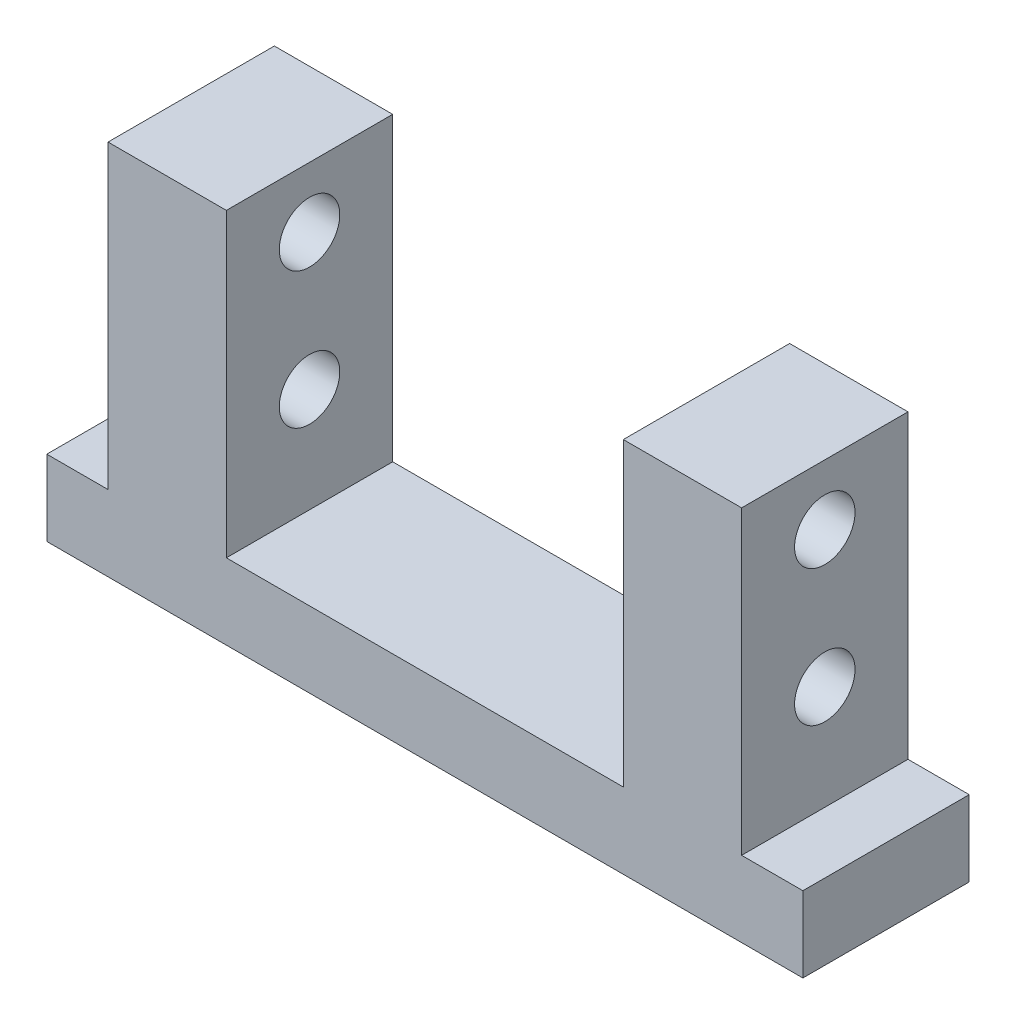
ISO-10303-21;
HEADER;
FILE_DESCRIPTION(('STEP AP214'),'2;1');
FILE_NAME('part.step','',(''),(''),'','','');
FILE_SCHEMA(('AUTOMOTIVE_DESIGN { 1 0 10303 214 1 1 1 1 }'));
ENDSEC;
DATA;
#1=APPLICATION_CONTEXT('core data for automotive mechanical design processes');
#2=APPLICATION_PROTOCOL_DEFINITION('international standard','automotive_design',2000,#1);
#3=PRODUCT_CONTEXT('',#1,'mechanical');
#4=PRODUCT('Part','Part','',(#3));
#5=PRODUCT_RELATED_PRODUCT_CATEGORY('part','',(#4));
#6=PRODUCT_DEFINITION_FORMATION('','',#4);
#7=PRODUCT_DEFINITION_CONTEXT('part definition',#1,'design');
#8=PRODUCT_DEFINITION('design','',#6,#7);
#9=PRODUCT_DEFINITION_SHAPE('','',#8);
#10=(LENGTH_UNIT() NAMED_UNIT(*) SI_UNIT(.MILLI.,.METRE.));
#11=(NAMED_UNIT(*) PLANE_ANGLE_UNIT() SI_UNIT($,.RADIAN.));
#12=(NAMED_UNIT(*) SI_UNIT($,.STERADIAN.) SOLID_ANGLE_UNIT());
#13=UNCERTAINTY_MEASURE_WITH_UNIT(LENGTH_MEASURE(1.E-05),#10,'distance_accuracy_value','');
#14=(GEOMETRIC_REPRESENTATION_CONTEXT(3) GLOBAL_UNCERTAINTY_ASSIGNED_CONTEXT((#13)) GLOBAL_UNIT_ASSIGNED_CONTEXT((#10,
#11,#12)) REPRESENTATION_CONTEXT('',''));
#15=CARTESIAN_POINT('',(0.,0.,0.));
#16=DIRECTION('',(0.,0.,1.));
#17=DIRECTION('',(1.,0.,0.));
#18=AXIS2_PLACEMENT_3D('',#15,#16,#17);
#19=CARTESIAN_POINT('',(0.,49.8,0.));
#20=DIRECTION('',(0.,1.,0.));
#21=DIRECTION('',(0.,0.,1.));
#22=AXIS2_PLACEMENT_3D('',#19,#20,#21);
#23=PLANE('',#22);
#24=DIRECTION('',(0.,0.,1.));
#25=VECTOR('',#24,1.);
#26=CARTESIAN_POINT('',(-26.25,49.8,11.));
#27=LINE('',#26,#25);
#28=CARTESIAN_POINT('',(-26.25,49.8,-11.));
#29=VERTEX_POINT('',#28);
#30=CARTESIAN_POINT('',(-26.25,49.8,11.));
#31=VERTEX_POINT('',#30);
#32=EDGE_CURVE('E128',#29,#31,#27,.T.);
#33=ORIENTED_EDGE('',*,*,#32,.F.);
#34=DIRECTION('',(-1.,0.,0.));
#35=VECTOR('',#34,1.);
#36=CARTESIAN_POINT('',(41.9,49.8,-11.));
#37=LINE('',#36,#35);
#38=CARTESIAN_POINT('',(-41.9,49.8,-11.));
#39=VERTEX_POINT('',#38);
#40=EDGE_CURVE('E169',#29,#39,#37,.T.);
#41=ORIENTED_EDGE('',*,*,#40,.T.);
#42=DIRECTION('',(0.,0.,1.));
#43=VECTOR('',#42,1.);
#44=CARTESIAN_POINT('',(-41.9,49.8,11.));
#45=LINE('',#44,#43);
#46=CARTESIAN_POINT('',(-41.9,49.8,11.));
#47=VERTEX_POINT('',#46);
#48=EDGE_CURVE('E161',#39,#47,#45,.T.);
#49=ORIENTED_EDGE('',*,*,#48,.T.);
#50=DIRECTION('',(1.,0.,0.));
#51=VECTOR('',#50,1.);
#52=CARTESIAN_POINT('',(41.9,49.8,11.));
#53=LINE('',#52,#51);
#54=EDGE_CURVE('E165',#47,#31,#53,.T.);
#55=ORIENTED_EDGE('',*,*,#54,.T.);
#56=EDGE_LOOP('',(#33,#41,#49,#55));
#57=FACE_BOUND('',#56,.T.);
#58=ADVANCED_FACE('F32',(#57),#23,.T.);
#59=CARTESIAN_POINT('',(0.,10.,0.));
#60=DIRECTION('',(0.,-1.,0.));
#61=DIRECTION('',(0.,0.,-1.));
#62=AXIS2_PLACEMENT_3D('',#59,#60,#61);
#63=PLANE('',#62);
#64=DIRECTION('',(0.,0.,1.));
#65=VECTOR('',#64,1.);
#66=CARTESIAN_POINT('',(-41.9,10.,11.));
#67=LINE('',#66,#65);
#68=CARTESIAN_POINT('',(-41.9,10.,-11.));
#69=VERTEX_POINT('',#68);
#70=CARTESIAN_POINT('',(-41.9,10.,11.));
#71=VERTEX_POINT('',#70);
#72=EDGE_CURVE('E156',#69,#71,#67,.T.);
#73=ORIENTED_EDGE('',*,*,#72,.F.);
#74=DIRECTION('',(-1.,0.,0.));
#75=VECTOR('',#74,1.);
#76=CARTESIAN_POINT('',(-50.,10.,-11.));
#77=LINE('',#76,#75);
#78=CARTESIAN_POINT('',(-50.,10.,-11.));
#79=VERTEX_POINT('',#78);
#80=EDGE_CURVE('E288',#69,#79,#77,.T.);
#81=ORIENTED_EDGE('',*,*,#80,.T.);
#82=DIRECTION('',(0.,0.,1.));
#83=VECTOR('',#82,1.);
#84=CARTESIAN_POINT('',(-50.,10.,11.));
#85=LINE('',#84,#83);
#86=CARTESIAN_POINT('',(-50.,10.,11.));
#87=VERTEX_POINT('',#86);
#88=EDGE_CURVE('E297',#79,#87,#85,.T.);
#89=ORIENTED_EDGE('',*,*,#88,.T.);
#90=DIRECTION('',(1.,0.,0.));
#91=VECTOR('',#90,1.);
#92=CARTESIAN_POINT('',(-50.,10.,11.));
#93=LINE('',#92,#91);
#94=EDGE_CURVE('E291',#87,#71,#93,.T.);
#95=ORIENTED_EDGE('',*,*,#94,.T.);
#96=EDGE_LOOP('',(#73,#81,#89,#95));
#97=FACE_BOUND('',#96,.T.);
#98=ADVANCED_FACE('F225',(#97),#63,.F.);
#99=DIRECTION('',(0.,0.,-1.));
#100=VECTOR('',#99,1.);
#101=CARTESIAN_POINT('',(41.9,10.,11.));
#102=LINE('',#101,#100);
#103=CARTESIAN_POINT('',(41.9,10.,11.));
#104=VERTEX_POINT('',#103);
#105=CARTESIAN_POINT('',(41.9,10.,-11.));
#106=VERTEX_POINT('',#105);
#107=EDGE_CURVE('E57',#104,#106,#102,.T.);
#108=ORIENTED_EDGE('',*,*,#107,.F.);
#109=CARTESIAN_POINT('',(50.,10.,11.));
#110=VERTEX_POINT('',#109);
#111=EDGE_CURVE('E252',#104,#110,#93,.T.);
#112=ORIENTED_EDGE('',*,*,#111,.T.);
#113=DIRECTION('',(0.,0.,-1.));
#114=VECTOR('',#113,1.);
#115=CARTESIAN_POINT('',(50.,10.,11.));
#116=LINE('',#115,#114);
#117=CARTESIAN_POINT('',(50.,10.,-11.));
#118=VERTEX_POINT('',#117);
#119=EDGE_CURVE('E295',#110,#118,#116,.T.);
#120=ORIENTED_EDGE('',*,*,#119,.T.);
#121=EDGE_CURVE('E294',#118,#106,#77,.T.);
#122=ORIENTED_EDGE('',*,*,#121,.T.);
#123=EDGE_LOOP('',(#108,#112,#120,#122));
#124=FACE_BOUND('',#123,.T.);
#125=ADVANCED_FACE('F232',(#124),#63,.F.);
#126=CARTESIAN_POINT('',(50.,10.,11.));
#127=DIRECTION('',(-1.,0.,0.));
#128=DIRECTION('',(0.,0.,1.));
#129=AXIS2_PLACEMENT_3D('',#126,#127,#128);
#130=PLANE('',#129);
#131=DIRECTION('',(0.,0.,-1.));
#132=VECTOR('',#131,1.);
#133=CARTESIAN_POINT('',(50.,0.,11.));
#134=LINE('',#133,#132);
#135=CARTESIAN_POINT('',(50.,0.,11.));
#136=VERTEX_POINT('',#135);
#137=CARTESIAN_POINT('',(50.,0.,-11.));
#138=VERTEX_POINT('',#137);
#139=EDGE_CURVE('E310',#136,#138,#134,.T.);
#140=ORIENTED_EDGE('',*,*,#139,.T.);
#141=DIRECTION('',(0.,-1.,0.));
#142=VECTOR('',#141,1.);
#143=CARTESIAN_POINT('',(50.,10.,-11.));
#144=LINE('',#143,#142);
#145=EDGE_CURVE('E11',#118,#138,#144,.T.);
#146=ORIENTED_EDGE('',*,*,#145,.F.);
#147=ORIENTED_EDGE('',*,*,#119,.F.);
#148=DIRECTION('',(0.,-1.,0.));
#149=VECTOR('',#148,1.);
#150=CARTESIAN_POINT('',(50.,10.,11.));
#151=LINE('',#150,#149);
#152=EDGE_CURVE('E328',#110,#136,#151,.T.);
#153=ORIENTED_EDGE('',*,*,#152,.T.);
#154=EDGE_LOOP('',(#140,#146,#147,#153));
#155=FACE_BOUND('',#154,.T.);
#156=ADVANCED_FACE('F34',(#155),#130,.F.);
#157=CARTESIAN_POINT('',(-50.,10.,-11.));
#158=DIRECTION('',(0.,0.,1.));
#159=DIRECTION('',(1.,0.,0.));
#160=AXIS2_PLACEMENT_3D('',#157,#158,#159);
#161=PLANE('',#160);
#162=ORIENTED_EDGE('',*,*,#40,.F.);
#163=DIRECTION('',(0.,1.,0.));
#164=VECTOR('',#163,1.);
#165=CARTESIAN_POINT('',(-26.25,10.,-11.));
#166=LINE('',#165,#164);
#167=CARTESIAN_POINT('',(-26.25,10.,-11.));
#168=VERTEX_POINT('',#167);
#169=EDGE_CURVE('E154',#168,#29,#166,.T.);
#170=ORIENTED_EDGE('',*,*,#169,.F.);
#171=DIRECTION('',(-1.,0.,0.));
#172=VECTOR('',#171,1.);
#173=CARTESIAN_POINT('',(26.25,10.,-11.));
#174=LINE('',#173,#172);
#175=CARTESIAN_POINT('',(26.25,10.,-11.));
#176=VERTEX_POINT('',#175);
#177=EDGE_CURVE('E132',#176,#168,#174,.T.);
#178=ORIENTED_EDGE('',*,*,#177,.F.);
#179=DIRECTION('',(0.,1.,0.));
#180=VECTOR('',#179,1.);
#181=CARTESIAN_POINT('',(26.25,10.,-11.));
#182=LINE('',#181,#180);
#183=CARTESIAN_POINT('',(26.25,49.8,-11.));
#184=VERTEX_POINT('',#183);
#185=EDGE_CURVE('E157',#176,#184,#182,.T.);
#186=ORIENTED_EDGE('',*,*,#185,.T.);
#187=CARTESIAN_POINT('',(41.9,49.8,-11.));
#188=VERTEX_POINT('',#187);
#189=EDGE_CURVE('E170',#188,#184,#37,.T.);
#190=ORIENTED_EDGE('',*,*,#189,.F.);
#191=DIRECTION('',(0.,-1.,0.));
#192=VECTOR('',#191,1.);
#193=CARTESIAN_POINT('',(41.9,49.8,-11.));
#194=LINE('',#193,#192);
#195=EDGE_CURVE('E186',#188,#106,#194,.T.);
#196=ORIENTED_EDGE('',*,*,#195,.T.);
#197=ORIENTED_EDGE('',*,*,#121,.F.);
#198=ORIENTED_EDGE('',*,*,#145,.T.);
#199=DIRECTION('',(-1.,0.,0.));
#200=VECTOR('',#199,1.);
#201=CARTESIAN_POINT('',(-50.,0.,-11.));
#202=LINE('',#201,#200);
#203=CARTESIAN_POINT('',(-50.,0.,-11.));
#204=VERTEX_POINT('',#203);
#205=EDGE_CURVE('E319',#138,#204,#202,.T.);
#206=ORIENTED_EDGE('',*,*,#205,.T.);
#207=DIRECTION('',(0.,-1.,0.));
#208=VECTOR('',#207,1.);
#209=CARTESIAN_POINT('',(-50.,10.,-11.));
#210=LINE('',#209,#208);
#211=EDGE_CURVE('E41',#79,#204,#210,.T.);
#212=ORIENTED_EDGE('',*,*,#211,.F.);
#213=ORIENTED_EDGE('',*,*,#80,.F.);
#214=DIRECTION('',(0.,-1.,0.));
#215=VECTOR('',#214,1.);
#216=CARTESIAN_POINT('',(-41.9,49.8,-11.));
#217=LINE('',#216,#215);
#218=EDGE_CURVE('E173',#39,#69,#217,.T.);
#219=ORIENTED_EDGE('',*,*,#218,.F.);
#220=EDGE_LOOP('',(#162,#170,#178,#186,#190,#196,#197,#198,#206,#212,#213,#219));
#221=FACE_BOUND('',#220,.T.);
#222=ADVANCED_FACE('F260',(#221),#161,.F.);
#223=CARTESIAN_POINT('',(-50.,10.,11.));
#224=DIRECTION('',(1.,0.,0.));
#225=DIRECTION('',(0.,0.,-1.));
#226=AXIS2_PLACEMENT_3D('',#223,#224,#225);
#227=PLANE('',#226);
#228=DIRECTION('',(0.,0.,1.));
#229=VECTOR('',#228,1.);
#230=CARTESIAN_POINT('',(-50.,0.,11.));
#231=LINE('',#230,#229);
#232=CARTESIAN_POINT('',(-50.,0.,11.));
#233=VERTEX_POINT('',#232);
#234=EDGE_CURVE('E324',#204,#233,#231,.T.);
#235=ORIENTED_EDGE('',*,*,#234,.T.);
#236=DIRECTION('',(0.,-1.,0.));
#237=VECTOR('',#236,1.);
#238=CARTESIAN_POINT('',(-50.,10.,11.));
#239=LINE('',#238,#237);
#240=EDGE_CURVE('E330',#87,#233,#239,.T.);
#241=ORIENTED_EDGE('',*,*,#240,.F.);
#242=ORIENTED_EDGE('',*,*,#88,.F.);
#243=ORIENTED_EDGE('',*,*,#211,.T.);
#244=EDGE_LOOP('',(#235,#241,#242,#243));
#245=FACE_BOUND('',#244,.T.);
#246=ADVANCED_FACE('F335',(#245),#227,.F.);
#247=CARTESIAN_POINT('',(-50.,10.,11.));
#248=DIRECTION('',(0.,0.,-1.));
#249=DIRECTION('',(-1.,0.,0.));
#250=AXIS2_PLACEMENT_3D('',#247,#248,#249);
#251=PLANE('',#250);
#252=DIRECTION('',(1.,0.,0.));
#253=VECTOR('',#252,1.);
#254=CARTESIAN_POINT('',(26.25,10.,11.));
#255=LINE('',#254,#253);
#256=CARTESIAN_POINT('',(-26.25,10.,11.));
#257=VERTEX_POINT('',#256);
#258=CARTESIAN_POINT('',(26.25,10.,11.));
#259=VERTEX_POINT('',#258);
#260=EDGE_CURVE('E138',#257,#259,#255,.T.);
#261=ORIENTED_EDGE('',*,*,#260,.F.);
#262=DIRECTION('',(0.,1.,0.));
#263=VECTOR('',#262,1.);
#264=CARTESIAN_POINT('',(-26.25,10.,11.));
#265=LINE('',#264,#263);
#266=EDGE_CURVE('E122',#257,#31,#265,.T.);
#267=ORIENTED_EDGE('',*,*,#266,.T.);
#268=ORIENTED_EDGE('',*,*,#54,.F.);
#269=DIRECTION('',(0.,-1.,0.));
#270=VECTOR('',#269,1.);
#271=CARTESIAN_POINT('',(-41.9,49.8,11.));
#272=LINE('',#271,#270);
#273=EDGE_CURVE('E253',#47,#71,#272,.T.);
#274=ORIENTED_EDGE('',*,*,#273,.T.);
#275=ORIENTED_EDGE('',*,*,#94,.F.);
#276=ORIENTED_EDGE('',*,*,#240,.T.);
#277=DIRECTION('',(1.,0.,0.));
#278=VECTOR('',#277,1.);
#279=CARTESIAN_POINT('',(-50.,0.,11.));
#280=LINE('',#279,#278);
#281=EDGE_CURVE('E300',#233,#136,#280,.T.);
#282=ORIENTED_EDGE('',*,*,#281,.T.);
#283=ORIENTED_EDGE('',*,*,#152,.F.);
#284=ORIENTED_EDGE('',*,*,#111,.F.);
#285=DIRECTION('',(0.,-1.,0.));
#286=VECTOR('',#285,1.);
#287=CARTESIAN_POINT('',(41.9,49.8,11.));
#288=LINE('',#287,#286);
#289=CARTESIAN_POINT('',(41.9,49.8,11.));
#290=VERTEX_POINT('',#289);
#291=EDGE_CURVE('E249',#290,#104,#288,.T.);
#292=ORIENTED_EDGE('',*,*,#291,.F.);
#293=CARTESIAN_POINT('',(26.25,49.8,11.));
#294=VERTEX_POINT('',#293);
#295=EDGE_CURVE('E164',#294,#290,#53,.T.);
#296=ORIENTED_EDGE('',*,*,#295,.F.);
#297=DIRECTION('',(0.,1.,0.));
#298=VECTOR('',#297,1.);
#299=CARTESIAN_POINT('',(26.25,10.,11.));
#300=LINE('',#299,#298);
#301=EDGE_CURVE('E49',#259,#294,#300,.T.);
#302=ORIENTED_EDGE('',*,*,#301,.F.);
#303=EDGE_LOOP('',(#261,#267,#268,#274,#275,#276,#282,#283,#284,#292,#296,#302));
#304=FACE_BOUND('',#303,.T.);
#305=ADVANCED_FACE('F143',(#304),#251,.F.);
#306=CARTESIAN_POINT('',(0.,0.,0.));
#307=DIRECTION('',(0.,-1.,0.));
#308=DIRECTION('',(0.,0.,-1.));
#309=AXIS2_PLACEMENT_3D('',#306,#307,#308);
#310=PLANE('',#309);
#311=ORIENTED_EDGE('',*,*,#139,.F.);
#312=ORIENTED_EDGE('',*,*,#281,.F.);
#313=ORIENTED_EDGE('',*,*,#234,.F.);
#314=ORIENTED_EDGE('',*,*,#205,.F.);
#315=EDGE_LOOP('',(#311,#312,#313,#314));
#316=FACE_BOUND('',#315,.T.);
#317=ADVANCED_FACE('F280',(#316),#310,.T.);
#318=CARTESIAN_POINT('',(-41.9,49.8,11.));
#319=DIRECTION('',(1.,0.,0.));
#320=DIRECTION('',(0.,0.,-1.));
#321=AXIS2_PLACEMENT_3D('',#318,#319,#320);
#322=PLANE('',#321);
#323=CARTESIAN_POINT('',(-41.9,23.8,0.));
#324=DIRECTION('',(-1.,0.,0.));
#325=DIRECTION('',(0.,0.,1.));
#326=AXIS2_PLACEMENT_3D('',#323,#324,#325);
#327=CIRCLE('',#326,4.);
#328=CARTESIAN_POINT('',(-41.9,23.8,4.));
#329=VERTEX_POINT('',#328);
#330=EDGE_CURVE('E269',#329,#329,#327,.T.);
#331=ORIENTED_EDGE('',*,*,#330,.F.);
#332=EDGE_LOOP('',(#331));
#333=FACE_BOUND('',#332,.T.);
#334=CARTESIAN_POINT('',(-41.9,41.8,0.));
#335=DIRECTION('',(-1.,0.,0.));
#336=DIRECTION('',(0.,0.,1.));
#337=AXIS2_PLACEMENT_3D('',#334,#335,#336);
#338=CIRCLE('',#337,4.);
#339=CARTESIAN_POINT('',(-41.9,41.8,4.));
#340=VERTEX_POINT('',#339);
#341=EDGE_CURVE('E191',#340,#340,#338,.T.);
#342=ORIENTED_EDGE('',*,*,#341,.F.);
#343=EDGE_LOOP('',(#342));
#344=FACE_BOUND('',#343,.T.);
#345=ORIENTED_EDGE('',*,*,#72,.T.);
#346=ORIENTED_EDGE('',*,*,#273,.F.);
#347=ORIENTED_EDGE('',*,*,#48,.F.);
#348=ORIENTED_EDGE('',*,*,#218,.T.);
#349=EDGE_LOOP('',(#345,#346,#347,#348));
#350=FACE_BOUND('',#349,.T.);
#351=ADVANCED_FACE('F244',(#333,#344,#350),#322,.F.);
#352=CARTESIAN_POINT('',(41.9,49.8,11.));
#353=DIRECTION('',(-1.,0.,0.));
#354=DIRECTION('',(0.,0.,1.));
#355=AXIS2_PLACEMENT_3D('',#352,#353,#354);
#356=PLANE('',#355);
#357=CARTESIAN_POINT('',(41.9,23.8,0.));
#358=DIRECTION('',(-1.,0.,0.));
#359=DIRECTION('',(0.,0.,1.));
#360=AXIS2_PLACEMENT_3D('',#357,#358,#359);
#361=CIRCLE('',#360,4.);
#362=CARTESIAN_POINT('',(41.9,23.8,4.));
#363=VERTEX_POINT('',#362);
#364=EDGE_CURVE('E197',#363,#363,#361,.T.);
#365=ORIENTED_EDGE('',*,*,#364,.T.);
#366=EDGE_LOOP('',(#365));
#367=FACE_BOUND('',#366,.T.);
#368=CARTESIAN_POINT('',(41.9,41.8,0.));
#369=DIRECTION('',(-1.,0.,0.));
#370=DIRECTION('',(0.,0.,1.));
#371=AXIS2_PLACEMENT_3D('',#368,#369,#370);
#372=CIRCLE('',#371,4.);
#373=CARTESIAN_POINT('',(41.9,41.8,4.));
#374=VERTEX_POINT('',#373);
#375=EDGE_CURVE('E152',#374,#374,#372,.T.);
#376=ORIENTED_EDGE('',*,*,#375,.T.);
#377=EDGE_LOOP('',(#376));
#378=FACE_BOUND('',#377,.T.);
#379=ORIENTED_EDGE('',*,*,#107,.T.);
#380=ORIENTED_EDGE('',*,*,#195,.F.);
#381=DIRECTION('',(0.,0.,-1.));
#382=VECTOR('',#381,1.);
#383=CARTESIAN_POINT('',(41.9,49.8,11.));
#384=LINE('',#383,#382);
#385=EDGE_CURVE('E167',#290,#188,#384,.T.);
#386=ORIENTED_EDGE('',*,*,#385,.F.);
#387=ORIENTED_EDGE('',*,*,#291,.T.);
#388=EDGE_LOOP('',(#379,#380,#386,#387));
#389=FACE_BOUND('',#388,.T.);
#390=ADVANCED_FACE('F208',(#367,#378,#389),#356,.F.);
#391=DIRECTION('',(0.,0.,-1.));
#392=VECTOR('',#391,1.);
#393=CARTESIAN_POINT('',(26.25,49.8,11.));
#394=LINE('',#393,#392);
#395=EDGE_CURVE('E141',#294,#184,#394,.T.);
#396=ORIENTED_EDGE('',*,*,#395,.F.);
#397=ORIENTED_EDGE('',*,*,#295,.T.);
#398=ORIENTED_EDGE('',*,*,#385,.T.);
#399=ORIENTED_EDGE('',*,*,#189,.T.);
#400=EDGE_LOOP('',(#396,#397,#398,#399));
#401=FACE_BOUND('',#400,.T.);
#402=ADVANCED_FACE('F228',(#401),#23,.T.);
#403=CARTESIAN_POINT('',(-26.25,10.,11.));
#404=DIRECTION('',(-1.,0.,0.));
#405=DIRECTION('',(0.,0.,1.));
#406=AXIS2_PLACEMENT_3D('',#403,#404,#405);
#407=PLANE('',#406);
#408=CARTESIAN_POINT('',(-26.25,23.8,0.));
#409=DIRECTION('',(-1.,0.,0.));
#410=DIRECTION('',(0.,0.,1.));
#411=AXIS2_PLACEMENT_3D('',#408,#409,#410);
#412=CIRCLE('',#411,4.);
#413=CARTESIAN_POINT('',(-26.25,23.8,4.));
#414=VERTEX_POINT('',#413);
#415=EDGE_CURVE('E202',#414,#414,#412,.T.);
#416=ORIENTED_EDGE('',*,*,#415,.T.);
#417=EDGE_LOOP('',(#416));
#418=FACE_BOUND('',#417,.T.);
#419=CARTESIAN_POINT('',(-26.25,41.8,0.));
#420=DIRECTION('',(-1.,0.,0.));
#421=DIRECTION('',(0.,0.,1.));
#422=AXIS2_PLACEMENT_3D('',#419,#420,#421);
#423=CIRCLE('',#422,4.);
#424=CARTESIAN_POINT('',(-26.25,41.8,4.));
#425=VERTEX_POINT('',#424);
#426=EDGE_CURVE('E190',#425,#425,#423,.T.);
#427=ORIENTED_EDGE('',*,*,#426,.T.);
#428=EDGE_LOOP('',(#427));
#429=FACE_BOUND('',#428,.T.);
#430=ORIENTED_EDGE('',*,*,#32,.T.);
#431=ORIENTED_EDGE('',*,*,#266,.F.);
#432=DIRECTION('',(0.,0.,1.));
#433=VECTOR('',#432,1.);
#434=CARTESIAN_POINT('',(-26.25,10.,11.));
#435=LINE('',#434,#433);
#436=EDGE_CURVE('E125',#168,#257,#435,.T.);
#437=ORIENTED_EDGE('',*,*,#436,.F.);
#438=ORIENTED_EDGE('',*,*,#169,.T.);
#439=EDGE_LOOP('',(#430,#431,#437,#438));
#440=FACE_BOUND('',#439,.T.);
#441=ADVANCED_FACE('F124',(#418,#429,#440),#407,.F.);
#442=CARTESIAN_POINT('',(26.25,10.,11.));
#443=DIRECTION('',(1.,0.,0.));
#444=DIRECTION('',(0.,0.,-1.));
#445=AXIS2_PLACEMENT_3D('',#442,#443,#444);
#446=PLANE('',#445);
#447=CARTESIAN_POINT('',(26.25,23.8,0.));
#448=DIRECTION('',(1.,0.,0.));
#449=DIRECTION('',(0.,0.,-1.));
#450=AXIS2_PLACEMENT_3D('',#447,#448,#449);
#451=CIRCLE('',#450,4.);
#452=CARTESIAN_POINT('',(26.25,23.8,-4.));
#453=VERTEX_POINT('',#452);
#454=EDGE_CURVE('E36',#453,#453,#451,.T.);
#455=ORIENTED_EDGE('',*,*,#454,.T.);
#456=EDGE_LOOP('',(#455));
#457=FACE_BOUND('',#456,.T.);
#458=CARTESIAN_POINT('',(26.25,41.8,0.));
#459=DIRECTION('',(1.,0.,0.));
#460=DIRECTION('',(0.,0.,-1.));
#461=AXIS2_PLACEMENT_3D('',#458,#459,#460);
#462=CIRCLE('',#461,4.);
#463=CARTESIAN_POINT('',(26.25,41.8,-4.));
#464=VERTEX_POINT('',#463);
#465=EDGE_CURVE('E188',#464,#464,#462,.T.);
#466=ORIENTED_EDGE('',*,*,#465,.T.);
#467=EDGE_LOOP('',(#466));
#468=FACE_BOUND('',#467,.T.);
#469=ORIENTED_EDGE('',*,*,#395,.T.);
#470=ORIENTED_EDGE('',*,*,#185,.F.);
#471=DIRECTION('',(0.,0.,-1.));
#472=VECTOR('',#471,1.);
#473=CARTESIAN_POINT('',(26.25,10.,11.));
#474=LINE('',#473,#472);
#475=EDGE_CURVE('E145',#259,#176,#474,.T.);
#476=ORIENTED_EDGE('',*,*,#475,.F.);
#477=ORIENTED_EDGE('',*,*,#301,.T.);
#478=EDGE_LOOP('',(#469,#470,#476,#477));
#479=FACE_BOUND('',#478,.T.);
#480=ADVANCED_FACE('F221',(#457,#468,#479),#446,.F.);
#481=CARTESIAN_POINT('',(0.,10.,0.));
#482=DIRECTION('',(0.,1.,0.));
#483=DIRECTION('',(0.,0.,1.));
#484=AXIS2_PLACEMENT_3D('',#481,#482,#483);
#485=PLANE('',#484);
#486=ORIENTED_EDGE('',*,*,#436,.T.);
#487=ORIENTED_EDGE('',*,*,#260,.T.);
#488=ORIENTED_EDGE('',*,*,#475,.T.);
#489=ORIENTED_EDGE('',*,*,#177,.T.);
#490=EDGE_LOOP('',(#486,#487,#488,#489));
#491=FACE_BOUND('',#490,.T.);
#492=ADVANCED_FACE('F136',(#491),#485,.T.);
#493=CARTESIAN_POINT('',(50.000025,41.8,0.));
#494=DIRECTION('',(-1.,0.,0.));
#495=DIRECTION('',(0.,0.,1.));
#496=AXIS2_PLACEMENT_3D('',#493,#494,#495);
#497=CYLINDRICAL_SURFACE('',#496,4.);
#498=ORIENTED_EDGE('',*,*,#465,.F.);
#499=EDGE_LOOP('',(#498));
#500=FACE_BOUND('',#499,.T.);
#501=ORIENTED_EDGE('',*,*,#375,.F.);
#502=EDGE_LOOP('',(#501));
#503=FACE_BOUND('',#502,.T.);
#504=ADVANCED_FACE('F211',(#500,#503),#497,.F.);
#505=ORIENTED_EDGE('',*,*,#341,.T.);
#506=EDGE_LOOP('',(#505));
#507=FACE_BOUND('',#506,.T.);
#508=ORIENTED_EDGE('',*,*,#426,.F.);
#509=EDGE_LOOP('',(#508));
#510=FACE_BOUND('',#509,.T.);
#511=ADVANCED_FACE('F213',(#507,#510),#497,.F.);
#512=CARTESIAN_POINT('',(50.000025,23.8,0.));
#513=DIRECTION('',(-1.,0.,0.));
#514=DIRECTION('',(0.,0.,1.));
#515=AXIS2_PLACEMENT_3D('',#512,#513,#514);
#516=CYLINDRICAL_SURFACE('',#515,4.);
#517=ORIENTED_EDGE('',*,*,#454,.F.);
#518=EDGE_LOOP('',(#517));
#519=FACE_BOUND('',#518,.T.);
#520=ORIENTED_EDGE('',*,*,#364,.F.);
#521=EDGE_LOOP('',(#520));
#522=FACE_BOUND('',#521,.T.);
#523=ADVANCED_FACE('F220',(#519,#522),#516,.F.);
#524=ORIENTED_EDGE('',*,*,#330,.T.);
#525=EDGE_LOOP('',(#524));
#526=FACE_BOUND('',#525,.T.);
#527=ORIENTED_EDGE('',*,*,#415,.F.);
#528=EDGE_LOOP('',(#527));
#529=FACE_BOUND('',#528,.T.);
#530=ADVANCED_FACE('F275',(#526,#529),#516,.F.);
#531=CLOSED_SHELL('',(#58,#98,#125,#156,#222,#246,#305,#317,#351,#390,#402,#441,#480,#492,#504,
#511,#523,#530));
#532=MANIFOLD_SOLID_BREP('B2',#531);
#533=ADVANCED_BREP_SHAPE_REPRESENTATION('',(#18,#532),#14);
#534=SHAPE_DEFINITION_REPRESENTATION(#9,#533);
ENDSEC;
END-ISO-10303-21;
